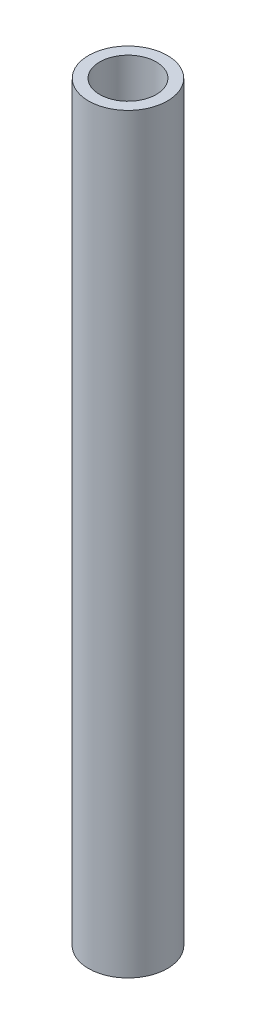
ISO-10303-21;
HEADER;
FILE_DESCRIPTION(('STEP AP214'),'2;1');
FILE_NAME('part.step','',(''),(''),'','','');
FILE_SCHEMA(('AUTOMOTIVE_DESIGN { 1 0 10303 214 1 1 1 1 }'));
ENDSEC;
DATA;
#1=APPLICATION_CONTEXT('core data for automotive mechanical design processes');
#2=APPLICATION_PROTOCOL_DEFINITION('international standard','automotive_design',2000,#1);
#3=PRODUCT_CONTEXT('',#1,'mechanical');
#4=PRODUCT('Part','Part','',(#3));
#5=PRODUCT_RELATED_PRODUCT_CATEGORY('part','',(#4));
#6=PRODUCT_DEFINITION_FORMATION('','',#4);
#7=PRODUCT_DEFINITION_CONTEXT('part definition',#1,'design');
#8=PRODUCT_DEFINITION('design','',#6,#7);
#9=PRODUCT_DEFINITION_SHAPE('','',#8);
#10=(LENGTH_UNIT() NAMED_UNIT(*) SI_UNIT(.MILLI.,.METRE.));
#11=(NAMED_UNIT(*) PLANE_ANGLE_UNIT() SI_UNIT($,.RADIAN.));
#12=(NAMED_UNIT(*) SI_UNIT($,.STERADIAN.) SOLID_ANGLE_UNIT());
#13=UNCERTAINTY_MEASURE_WITH_UNIT(LENGTH_MEASURE(1.E-05),#10,'distance_accuracy_value','');
#14=(GEOMETRIC_REPRESENTATION_CONTEXT(3) GLOBAL_UNCERTAINTY_ASSIGNED_CONTEXT((#13)) GLOBAL_UNIT_ASSIGNED_CONTEXT((#10,
#11,#12)) REPRESENTATION_CONTEXT('',''));
#15=CARTESIAN_POINT('',(0.,0.,0.));
#16=DIRECTION('',(0.,0.,1.));
#17=DIRECTION('',(1.,0.,0.));
#18=AXIS2_PLACEMENT_3D('',#15,#16,#17);
#19=CARTESIAN_POINT('',(0.,203.2,0.));
#20=DIRECTION('',(0.,1.,0.));
#21=DIRECTION('',(0.,0.,1.));
#22=AXIS2_PLACEMENT_3D('',#19,#20,#21);
#23=PLANE('',#22);
#24=CARTESIAN_POINT('',(0.,203.2,0.));
#25=DIRECTION('',(0.,1.,0.));
#26=DIRECTION('',(0.,0.,1.));
#27=AXIS2_PLACEMENT_3D('',#24,#25,#26);
#28=CIRCLE('',#27,10.668);
#29=CARTESIAN_POINT('',(0.,203.2,10.668));
#30=VERTEX_POINT('',#29);
#31=EDGE_CURVE('E10',#30,#30,#28,.T.);
#32=ORIENTED_EDGE('',*,*,#31,.T.);
#33=EDGE_LOOP('',(#32));
#34=FACE_BOUND('',#33,.T.);
#35=CARTESIAN_POINT('',(0.,203.2,0.));
#36=DIRECTION('',(0.,1.,0.));
#37=DIRECTION('',(0.,0.,1.));
#38=AXIS2_PLACEMENT_3D('',#35,#36,#37);
#39=CIRCLE('',#38,7.6454);
#40=CARTESIAN_POINT('',(0.,203.2,7.6454));
#41=VERTEX_POINT('',#40);
#42=EDGE_CURVE('E56',#41,#41,#39,.T.);
#43=ORIENTED_EDGE('',*,*,#42,.F.);
#44=EDGE_LOOP('',(#43));
#45=FACE_BOUND('',#44,.T.);
#46=ADVANCED_FACE('F45',(#34,#45),#23,.T.);
#47=CARTESIAN_POINT('',(0.,0.,0.));
#48=DIRECTION('',(0.,1.,0.));
#49=DIRECTION('',(0.,0.,1.));
#50=AXIS2_PLACEMENT_3D('',#47,#48,#49);
#51=PLANE('',#50);
#52=CARTESIAN_POINT('',(0.,0.,0.));
#53=DIRECTION('',(0.,1.,0.));
#54=DIRECTION('',(0.,0.,1.));
#55=AXIS2_PLACEMENT_3D('',#52,#53,#54);
#56=CIRCLE('',#55,10.668);
#57=CARTESIAN_POINT('',(0.,0.,10.668));
#58=VERTEX_POINT('',#57);
#59=EDGE_CURVE('E49',#58,#58,#56,.T.);
#60=ORIENTED_EDGE('',*,*,#59,.F.);
#61=EDGE_LOOP('',(#60));
#62=FACE_BOUND('',#61,.T.);
#63=CARTESIAN_POINT('',(0.,0.,0.));
#64=DIRECTION('',(0.,1.,0.));
#65=DIRECTION('',(0.,0.,1.));
#66=AXIS2_PLACEMENT_3D('',#63,#64,#65);
#67=CIRCLE('',#66,7.6454);
#68=CARTESIAN_POINT('',(0.,0.,7.6454));
#69=VERTEX_POINT('',#68);
#70=EDGE_CURVE('E58',#69,#69,#67,.T.);
#71=ORIENTED_EDGE('',*,*,#70,.T.);
#72=EDGE_LOOP('',(#71));
#73=FACE_BOUND('',#72,.T.);
#74=ADVANCED_FACE('F68',(#62,#73),#51,.F.);
#75=CARTESIAN_POINT('',(0.,203.2,0.));
#76=DIRECTION('',(0.,-1.,0.));
#77=DIRECTION('',(0.,0.,-1.));
#78=AXIS2_PLACEMENT_3D('',#75,#76,#77);
#79=CYLINDRICAL_SURFACE('',#78,10.668);
#80=ORIENTED_EDGE('',*,*,#31,.F.);
#81=EDGE_LOOP('',(#80));
#82=FACE_BOUND('',#81,.T.);
#83=ORIENTED_EDGE('',*,*,#59,.T.);
#84=EDGE_LOOP('',(#83));
#85=FACE_BOUND('',#84,.T.);
#86=ADVANCED_FACE('F47',(#82,#85),#79,.T.);
#87=CARTESIAN_POINT('',(0.,203.2,0.));
#88=DIRECTION('',(0.,-1.,0.));
#89=DIRECTION('',(0.,0.,-1.));
#90=AXIS2_PLACEMENT_3D('',#87,#88,#89);
#91=CYLINDRICAL_SURFACE('',#90,7.6454);
#92=ORIENTED_EDGE('',*,*,#42,.T.);
#93=EDGE_LOOP('',(#92));
#94=FACE_BOUND('',#93,.T.);
#95=ORIENTED_EDGE('',*,*,#70,.F.);
#96=EDGE_LOOP('',(#95));
#97=FACE_BOUND('',#96,.T.);
#98=ADVANCED_FACE('F64',(#94,#97),#91,.F.);
#99=CLOSED_SHELL('',(#46,#74,#86,#98));
#100=MANIFOLD_SOLID_BREP('B2',#99);
#101=ADVANCED_BREP_SHAPE_REPRESENTATION('',(#18,#100),#14);
#102=SHAPE_DEFINITION_REPRESENTATION(#9,#101);
ENDSEC;
END-ISO-10303-21;
